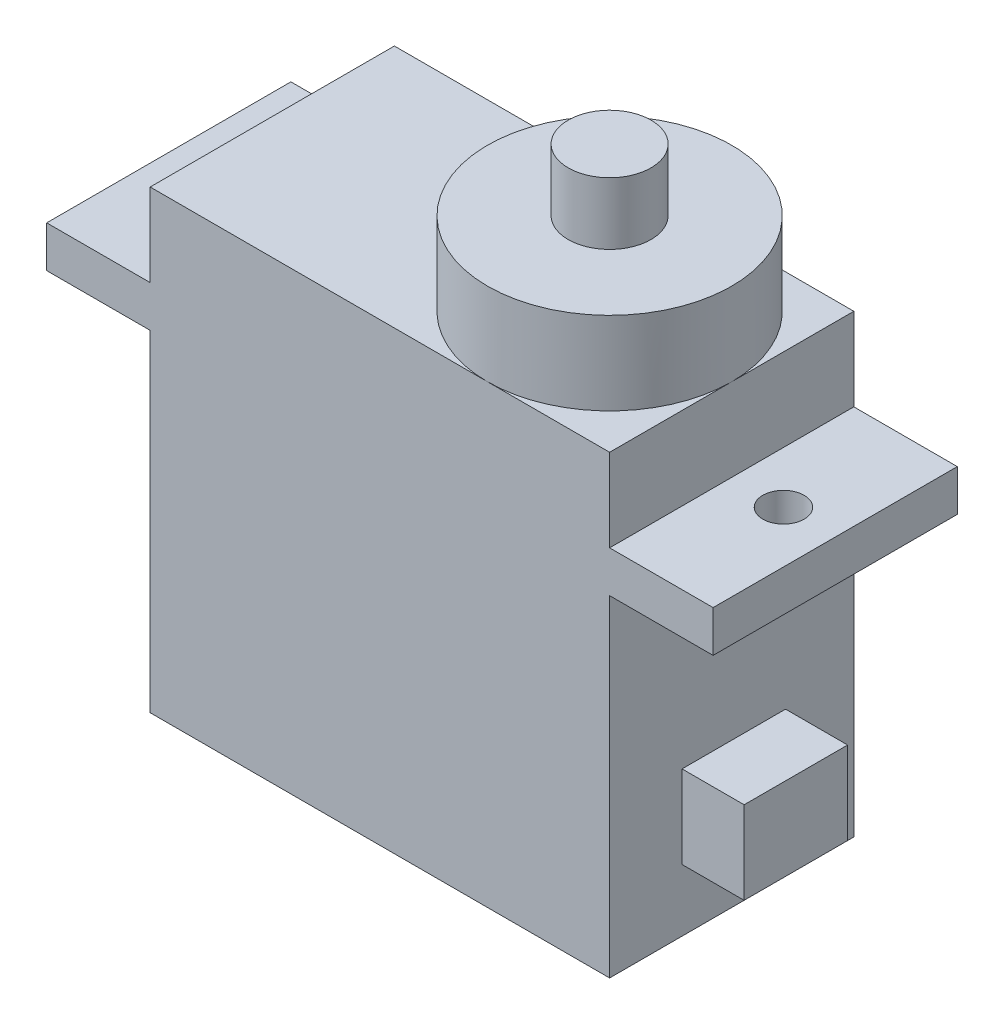
ISO-10303-21;
HEADER;
FILE_DESCRIPTION(('STEP AP214'),'2;1');
FILE_NAME('part.step','',(''),(''),'','','');
FILE_SCHEMA(('AUTOMOTIVE_DESIGN { 1 0 10303 214 1 1 1 1 }'));
ENDSEC;
DATA;
#1=APPLICATION_CONTEXT('core data for automotive mechanical design processes');
#2=APPLICATION_PROTOCOL_DEFINITION('international standard','automotive_design',2000,#1);
#3=PRODUCT_CONTEXT('',#1,'mechanical');
#4=PRODUCT('Part','Part','',(#3));
#5=PRODUCT_RELATED_PRODUCT_CATEGORY('part','',(#4));
#6=PRODUCT_DEFINITION_FORMATION('','',#4);
#7=PRODUCT_DEFINITION_CONTEXT('part definition',#1,'design');
#8=PRODUCT_DEFINITION('design','',#6,#7);
#9=PRODUCT_DEFINITION_SHAPE('','',#8);
#10=(LENGTH_UNIT() NAMED_UNIT(*) SI_UNIT(.MILLI.,.METRE.));
#11=(NAMED_UNIT(*) PLANE_ANGLE_UNIT() SI_UNIT($,.RADIAN.));
#12=(NAMED_UNIT(*) SI_UNIT($,.STERADIAN.) SOLID_ANGLE_UNIT());
#13=UNCERTAINTY_MEASURE_WITH_UNIT(LENGTH_MEASURE(1.E-05),#10,'distance_accuracy_value','');
#14=(GEOMETRIC_REPRESENTATION_CONTEXT(3) GLOBAL_UNCERTAINTY_ASSIGNED_CONTEXT((#13)) GLOBAL_UNIT_ASSIGNED_CONTEXT((#10,
#11,#12)) REPRESENTATION_CONTEXT('',''));
#15=CARTESIAN_POINT('',(0.,0.,0.));
#16=DIRECTION('',(0.,0.,1.));
#17=DIRECTION('',(1.,0.,0.));
#18=AXIS2_PLACEMENT_3D('',#15,#16,#17);
#19=CARTESIAN_POINT('',(-17.9964599489545,16.,11.8));
#20=DIRECTION('',(-1.,0.,0.));
#21=DIRECTION('',(0.,0.,1.));
#22=AXIS2_PLACEMENT_3D('',#19,#20,#21);
#23=PLANE('',#22);
#24=DIRECTION('',(0.,1.,0.));
#25=VECTOR('',#24,1.);
#26=CARTESIAN_POINT('',(-17.9964599489545,16.,0.));
#27=LINE('',#26,#25);
#28=CARTESIAN_POINT('',(-17.9964599489545,0.,0.));
#29=VERTEX_POINT('',#28);
#30=CARTESIAN_POINT('',(-17.9964599489545,16.,0.));
#31=VERTEX_POINT('',#30);
#32=EDGE_CURVE('E243',#29,#31,#27,.T.);
#33=ORIENTED_EDGE('',*,*,#32,.T.);
#34=DIRECTION('',(0.,0.,-1.));
#35=VECTOR('',#34,1.);
#36=CARTESIAN_POINT('',(-17.9964599489545,16.,11.8));
#37=LINE('',#36,#35);
#38=CARTESIAN_POINT('',(-17.9964599489545,16.,11.8));
#39=VERTEX_POINT('',#38);
#40=EDGE_CURVE('E282',#39,#31,#37,.T.);
#41=ORIENTED_EDGE('',*,*,#40,.F.);
#42=DIRECTION('',(0.,1.,0.));
#43=VECTOR('',#42,1.);
#44=CARTESIAN_POINT('',(-17.9964599489545,16.,11.8));
#45=LINE('',#44,#43);
#46=CARTESIAN_POINT('',(-17.9964599489545,0.,11.8));
#47=VERTEX_POINT('',#46);
#48=EDGE_CURVE('E217',#47,#39,#45,.T.);
#49=ORIENTED_EDGE('',*,*,#48,.F.);
#50=DIRECTION('',(0.,0.,-1.));
#51=VECTOR('',#50,1.);
#52=CARTESIAN_POINT('',(-17.9964599489545,0.,11.8));
#53=LINE('',#52,#51);
#54=EDGE_CURVE('E285',#47,#29,#53,.T.);
#55=ORIENTED_EDGE('',*,*,#54,.T.);
#56=EDGE_LOOP('',(#33,#41,#49,#55));
#57=FACE_BOUND('',#56,.T.);
#58=DIRECTION('',(0.,-1.,0.));
#59=VECTOR('',#58,1.);
#60=CARTESIAN_POINT('',(-17.9964599489545,2.99999999999999,8.3));
#61=LINE('',#60,#59);
#62=CARTESIAN_POINT('',(-17.9964599489545,6.99999999999999,8.3));
#63=VERTEX_POINT('',#62);
#64=CARTESIAN_POINT('',(-17.9964599489545,3.,8.3));
#65=VERTEX_POINT('',#64);
#66=EDGE_CURVE('E178',#63,#65,#61,.T.);
#67=ORIENTED_EDGE('',*,*,#66,.F.);
#68=DIRECTION('',(0.,0.,1.));
#69=VECTOR('',#68,1.);
#70=CARTESIAN_POINT('',(-17.9964599489545,6.99999999999999,8.3));
#71=LINE('',#70,#69);
#72=CARTESIAN_POINT('',(-17.9964599489545,7.,3.3));
#73=VERTEX_POINT('',#72);
#74=EDGE_CURVE('E175',#73,#63,#71,.T.);
#75=ORIENTED_EDGE('',*,*,#74,.F.);
#76=DIRECTION('',(0.,1.,0.));
#77=VECTOR('',#76,1.);
#78=CARTESIAN_POINT('',(-17.9964599489545,2.99999999999999,3.3));
#79=LINE('',#78,#77);
#80=CARTESIAN_POINT('',(-17.9964599489545,2.99999999999999,3.3));
#81=VERTEX_POINT('',#80);
#82=EDGE_CURVE('E56',#81,#73,#79,.T.);
#83=ORIENTED_EDGE('',*,*,#82,.F.);
#84=DIRECTION('',(0.,0.,-1.));
#85=VECTOR('',#84,1.);
#86=CARTESIAN_POINT('',(-17.9964599489545,2.99999999999999,8.3));
#87=LINE('',#86,#85);
#88=EDGE_CURVE('E51',#65,#81,#87,.T.);
#89=ORIENTED_EDGE('',*,*,#88,.F.);
#90=EDGE_LOOP('',(#67,#75,#83,#89));
#91=FACE_BOUND('',#90,.T.);
#92=ADVANCED_FACE('F33',(#57,#91),#23,.F.);
#93=CARTESIAN_POINT('',(-23.8964599489545,26.,5.9));
#94=DIRECTION('',(0.,1.,0.));
#95=DIRECTION('',(0.,0.,1.));
#96=AXIS2_PLACEMENT_3D('',#93,#94,#95);
#97=PLANE('',#96);
#98=CARTESIAN_POINT('',(-23.8964599489545,26.,5.9));
#99=DIRECTION('',(0.,1.,0.));
#100=DIRECTION('',(0.,0.,1.));
#101=AXIS2_PLACEMENT_3D('',#98,#99,#100);
#102=CIRCLE('',#101,5.9);
#103=CARTESIAN_POINT('',(-23.8964599489545,26.,11.8));
#104=VERTEX_POINT('',#103);
#105=EDGE_CURVE('E190',#104,#104,#102,.T.);
#106=ORIENTED_EDGE('',*,*,#105,.T.);
#107=EDGE_LOOP('',(#106));
#108=FACE_BOUND('',#107,.T.);
#109=CARTESIAN_POINT('',(-23.8964599489545,26.,5.9));
#110=DIRECTION('',(0.,1.,0.));
#111=DIRECTION('',(0.,0.,1.));
#112=AXIS2_PLACEMENT_3D('',#109,#110,#111);
#113=CIRCLE('',#112,2.);
#114=CARTESIAN_POINT('',(-23.8964599489545,26.,7.9));
#115=VERTEX_POINT('',#114);
#116=EDGE_CURVE('E179',#115,#115,#113,.T.);
#117=ORIENTED_EDGE('',*,*,#116,.F.);
#118=EDGE_LOOP('',(#117));
#119=FACE_BOUND('',#118,.T.);
#120=ADVANCED_FACE('F365',(#108,#119),#97,.T.);
#121=CARTESIAN_POINT('',(-40.1964599489545,22.,11.8));
#122=DIRECTION('',(0.,-1.,0.));
#123=DIRECTION('',(0.,0.,-1.));
#124=AXIS2_PLACEMENT_3D('',#121,#122,#123);
#125=PLANE('',#124);
#126=CARTESIAN_POINT('',(-23.8964599489545,22.,5.9));
#127=DIRECTION('',(0.,1.,0.));
#128=DIRECTION('',(0.,0.,1.));
#129=AXIS2_PLACEMENT_3D('',#126,#127,#128);
#130=CIRCLE('',#129,5.9);
#131=CARTESIAN_POINT('',(-23.8964599489545,22.,11.8));
#132=VERTEX_POINT('',#131);
#133=CARTESIAN_POINT('',(-17.9964599489545,22.,5.9));
#134=VERTEX_POINT('',#133);
#135=EDGE_CURVE('E44',#132,#134,#130,.T.);
#136=ORIENTED_EDGE('',*,*,#135,.F.);
#137=DIRECTION('',(-1.,0.,0.));
#138=VECTOR('',#137,1.);
#139=CARTESIAN_POINT('',(-40.1964599489545,22.,11.8));
#140=LINE('',#139,#138);
#141=CARTESIAN_POINT('',(-17.9964599489545,22.,11.8));
#142=VERTEX_POINT('',#141);
#143=EDGE_CURVE('E228',#142,#132,#140,.T.);
#144=ORIENTED_EDGE('',*,*,#143,.F.);
#145=DIRECTION('',(0.,0.,-1.));
#146=VECTOR('',#145,1.);
#147=CARTESIAN_POINT('',(-17.9964599489545,22.,11.8));
#148=LINE('',#147,#146);
#149=EDGE_CURVE('E270',#142,#134,#148,.T.);
#150=ORIENTED_EDGE('',*,*,#149,.T.);
#151=EDGE_LOOP('',(#136,#144,#150));
#152=FACE_BOUND('',#151,.T.);
#153=ADVANCED_FACE('F363',(#152),#125,.F.);
#154=CARTESIAN_POINT('',(-23.8964599489545,22.,0.));
#155=VERTEX_POINT('',#154);
#156=EDGE_CURVE('E11',#134,#155,#130,.T.);
#157=ORIENTED_EDGE('',*,*,#156,.F.);
#158=CARTESIAN_POINT('',(-17.9964599489545,22.,0.));
#159=VERTEX_POINT('',#158);
#160=EDGE_CURVE('E269',#134,#159,#148,.T.);
#161=ORIENTED_EDGE('',*,*,#160,.T.);
#162=DIRECTION('',(-1.,0.,0.));
#163=VECTOR('',#162,1.);
#164=CARTESIAN_POINT('',(-40.1964599489545,22.,0.));
#165=LINE('',#164,#163);
#166=EDGE_CURVE('E255',#159,#155,#165,.T.);
#167=ORIENTED_EDGE('',*,*,#166,.T.);
#168=EDGE_LOOP('',(#157,#161,#167));
#169=FACE_BOUND('',#168,.T.);
#170=ADVANCED_FACE('F316',(#169),#125,.F.);
#171=EDGE_CURVE('E42',#155,#132,#130,.T.);
#172=ORIENTED_EDGE('',*,*,#171,.F.);
#173=CARTESIAN_POINT('',(-40.1964599489545,22.,0.));
#174=VERTEX_POINT('',#173);
#175=EDGE_CURVE('E254',#155,#174,#165,.T.);
#176=ORIENTED_EDGE('',*,*,#175,.T.);
#177=DIRECTION('',(0.,0.,-1.));
#178=VECTOR('',#177,1.);
#179=CARTESIAN_POINT('',(-40.1964599489545,22.,11.8));
#180=LINE('',#179,#178);
#181=CARTESIAN_POINT('',(-40.1964599489545,22.,11.8));
#182=VERTEX_POINT('',#181);
#183=EDGE_CURVE('E266',#182,#174,#180,.T.);
#184=ORIENTED_EDGE('',*,*,#183,.F.);
#185=EDGE_CURVE('E227',#132,#182,#140,.T.);
#186=ORIENTED_EDGE('',*,*,#185,.F.);
#187=EDGE_LOOP('',(#172,#176,#184,#186));
#188=FACE_BOUND('',#187,.T.);
#189=ADVANCED_FACE('F306',(#188),#125,.F.);
#190=CARTESIAN_POINT('',(-45.1964599489545,16.,11.8));
#191=DIRECTION('',(1.,0.,0.));
#192=DIRECTION('',(0.,0.,-1.));
#193=AXIS2_PLACEMENT_3D('',#190,#191,#192);
#194=PLANE('',#193);
#195=DIRECTION('',(0.,-1.,0.));
#196=VECTOR('',#195,1.);
#197=CARTESIAN_POINT('',(-45.1964599489545,16.,0.));
#198=LINE('',#197,#196);
#199=CARTESIAN_POINT('',(-45.1964599489545,18.,0.));
#200=VERTEX_POINT('',#199);
#201=CARTESIAN_POINT('',(-45.1964599489545,16.,0.));
#202=VERTEX_POINT('',#201);
#203=EDGE_CURVE('E206',#200,#202,#198,.T.);
#204=ORIENTED_EDGE('',*,*,#203,.T.);
#205=DIRECTION('',(0.,0.,-1.));
#206=VECTOR('',#205,1.);
#207=CARTESIAN_POINT('',(-45.1964599489545,16.,11.8));
#208=LINE('',#207,#206);
#209=CARTESIAN_POINT('',(-45.1964599489545,16.,11.8));
#210=VERTEX_POINT('',#209);
#211=EDGE_CURVE('E37',#210,#202,#208,.T.);
#212=ORIENTED_EDGE('',*,*,#211,.F.);
#213=DIRECTION('',(0.,-1.,0.));
#214=VECTOR('',#213,1.);
#215=CARTESIAN_POINT('',(-45.1964599489545,16.,11.8));
#216=LINE('',#215,#214);
#217=CARTESIAN_POINT('',(-45.1964599489545,18.,11.8));
#218=VERTEX_POINT('',#217);
#219=EDGE_CURVE('E207',#218,#210,#216,.T.);
#220=ORIENTED_EDGE('',*,*,#219,.F.);
#221=DIRECTION('',(0.,0.,-1.));
#222=VECTOR('',#221,1.);
#223=CARTESIAN_POINT('',(-45.1964599489545,18.,11.8));
#224=LINE('',#223,#222);
#225=EDGE_CURVE('E234',#218,#200,#224,.T.);
#226=ORIENTED_EDGE('',*,*,#225,.T.);
#227=EDGE_LOOP('',(#204,#212,#220,#226));
#228=FACE_BOUND('',#227,.T.);
#229=ADVANCED_FACE('F35',(#228),#194,.F.);
#230=CARTESIAN_POINT('',(-40.1964599489545,16.,11.8));
#231=DIRECTION('',(0.,1.,0.));
#232=DIRECTION('',(-1.,0.,0.));
#233=AXIS2_PLACEMENT_3D('',#230,#231,#232);
#234=PLANE('',#233);
#235=CARTESIAN_POINT('',(-42.6964599489545,16.,5.9));
#236=DIRECTION('',(0.,1.,0.));
#237=DIRECTION('',(-1.,0.,0.));
#238=AXIS2_PLACEMENT_3D('',#235,#236,#237);
#239=CIRCLE('',#238,0.999999999999998);
#240=CARTESIAN_POINT('',(-43.6964599489545,16.,5.9));
#241=VERTEX_POINT('',#240);
#242=EDGE_CURVE('E203',#241,#241,#239,.T.);
#243=ORIENTED_EDGE('',*,*,#242,.T.);
#244=EDGE_LOOP('',(#243));
#245=FACE_BOUND('',#244,.T.);
#246=DIRECTION('',(1.,0.,0.));
#247=VECTOR('',#246,1.);
#248=CARTESIAN_POINT('',(-40.1964599489545,16.,0.));
#249=LINE('',#248,#247);
#250=CARTESIAN_POINT('',(-40.1964599489545,16.,0.));
#251=VERTEX_POINT('',#250);
#252=EDGE_CURVE('E237',#202,#251,#249,.T.);
#253=ORIENTED_EDGE('',*,*,#252,.T.);
#254=DIRECTION('',(0.,0.,-1.));
#255=VECTOR('',#254,1.);
#256=CARTESIAN_POINT('',(-40.1964599489545,16.,11.8));
#257=LINE('',#256,#255);
#258=CARTESIAN_POINT('',(-40.1964599489545,16.,11.8));
#259=VERTEX_POINT('',#258);
#260=EDGE_CURVE('E290',#259,#251,#257,.T.);
#261=ORIENTED_EDGE('',*,*,#260,.F.);
#262=DIRECTION('',(1.,0.,0.));
#263=VECTOR('',#262,1.);
#264=CARTESIAN_POINT('',(-40.1964599489545,16.,11.8));
#265=LINE('',#264,#263);
#266=EDGE_CURVE('E210',#210,#259,#265,.T.);
#267=ORIENTED_EDGE('',*,*,#266,.F.);
#268=ORIENTED_EDGE('',*,*,#211,.T.);
#269=EDGE_LOOP('',(#253,#261,#267,#268));
#270=FACE_BOUND('',#269,.T.);
#271=ADVANCED_FACE('F348',(#245,#270),#234,.F.);
#272=CARTESIAN_POINT('',(-40.1964599489545,0.,11.8));
#273=DIRECTION('',(1.,0.,0.));
#274=DIRECTION('',(0.,0.,-1.));
#275=AXIS2_PLACEMENT_3D('',#272,#273,#274);
#276=PLANE('',#275);
#277=DIRECTION('',(0.,-1.,0.));
#278=VECTOR('',#277,1.);
#279=CARTESIAN_POINT('',(-40.1964599489545,0.,0.));
#280=LINE('',#279,#278);
#281=CARTESIAN_POINT('',(-40.1964599489545,0.,0.));
#282=VERTEX_POINT('',#281);
#283=EDGE_CURVE('E239',#251,#282,#280,.T.);
#284=ORIENTED_EDGE('',*,*,#283,.T.);
#285=DIRECTION('',(0.,0.,-1.));
#286=VECTOR('',#285,1.);
#287=CARTESIAN_POINT('',(-40.1964599489545,0.,11.8));
#288=LINE('',#287,#286);
#289=CARTESIAN_POINT('',(-40.1964599489545,0.,11.8));
#290=VERTEX_POINT('',#289);
#291=EDGE_CURVE('E288',#290,#282,#288,.T.);
#292=ORIENTED_EDGE('',*,*,#291,.F.);
#293=DIRECTION('',(0.,-1.,0.));
#294=VECTOR('',#293,1.);
#295=CARTESIAN_POINT('',(-40.1964599489545,0.,11.8));
#296=LINE('',#295,#294);
#297=EDGE_CURVE('E213',#259,#290,#296,.T.);
#298=ORIENTED_EDGE('',*,*,#297,.F.);
#299=ORIENTED_EDGE('',*,*,#260,.T.);
#300=EDGE_LOOP('',(#284,#292,#298,#299));
#301=FACE_BOUND('',#300,.T.);
#302=ADVANCED_FACE('F347',(#301),#276,.F.);
#303=CARTESIAN_POINT('',(-17.9964599489545,0.,11.8));
#304=DIRECTION('',(0.,1.,0.));
#305=DIRECTION('',(-1.,0.,0.));
#306=AXIS2_PLACEMENT_3D('',#303,#304,#305);
#307=PLANE('',#306);
#308=DIRECTION('',(1.,0.,0.));
#309=VECTOR('',#308,1.);
#310=CARTESIAN_POINT('',(-17.9964599489545,0.,0.));
#311=LINE('',#310,#309);
#312=EDGE_CURVE('E241',#282,#29,#311,.T.);
#313=ORIENTED_EDGE('',*,*,#312,.T.);
#314=ORIENTED_EDGE('',*,*,#54,.F.);
#315=DIRECTION('',(1.,0.,0.));
#316=VECTOR('',#315,1.);
#317=CARTESIAN_POINT('',(-17.9964599489545,0.,11.8));
#318=LINE('',#317,#316);
#319=EDGE_CURVE('E215',#290,#47,#318,.T.);
#320=ORIENTED_EDGE('',*,*,#319,.F.);
#321=ORIENTED_EDGE('',*,*,#291,.T.);
#322=EDGE_LOOP('',(#313,#314,#320,#321));
#323=FACE_BOUND('',#322,.T.);
#324=ADVANCED_FACE('F345',(#323),#307,.F.);
#325=CARTESIAN_POINT('',(-12.9964599489545,16.,11.8));
#326=DIRECTION('',(0.,1.,0.));
#327=DIRECTION('',(0.,0.,1.));
#328=AXIS2_PLACEMENT_3D('',#325,#326,#327);
#329=PLANE('',#328);
#330=CARTESIAN_POINT('',(-15.4964599489545,16.,5.9));
#331=DIRECTION('',(0.,1.,0.));
#332=DIRECTION('',(0.,0.,1.));
#333=AXIS2_PLACEMENT_3D('',#330,#331,#332);
#334=CIRCLE('',#333,1.);
#335=CARTESIAN_POINT('',(-15.4964599489545,16.,6.9));
#336=VERTEX_POINT('',#335);
#337=EDGE_CURVE('E197',#336,#336,#334,.T.);
#338=ORIENTED_EDGE('',*,*,#337,.T.);
#339=EDGE_LOOP('',(#338));
#340=FACE_BOUND('',#339,.T.);
#341=DIRECTION('',(1.,0.,0.));
#342=VECTOR('',#341,1.);
#343=CARTESIAN_POINT('',(-12.9964599489545,16.,0.));
#344=LINE('',#343,#342);
#345=CARTESIAN_POINT('',(-12.9964599489545,16.,0.));
#346=VERTEX_POINT('',#345);
#347=EDGE_CURVE('E245',#31,#346,#344,.T.);
#348=ORIENTED_EDGE('',*,*,#347,.T.);
#349=DIRECTION('',(0.,0.,-1.));
#350=VECTOR('',#349,1.);
#351=CARTESIAN_POINT('',(-12.9964599489545,16.,11.8));
#352=LINE('',#351,#350);
#353=CARTESIAN_POINT('',(-12.9964599489545,16.,11.8));
#354=VERTEX_POINT('',#353);
#355=EDGE_CURVE('E279',#354,#346,#352,.T.);
#356=ORIENTED_EDGE('',*,*,#355,.F.);
#357=DIRECTION('',(1.,0.,0.));
#358=VECTOR('',#357,1.);
#359=CARTESIAN_POINT('',(-12.9964599489545,16.,11.8));
#360=LINE('',#359,#358);
#361=EDGE_CURVE('E219',#39,#354,#360,.T.);
#362=ORIENTED_EDGE('',*,*,#361,.F.);
#363=ORIENTED_EDGE('',*,*,#40,.T.);
#364=EDGE_LOOP('',(#348,#356,#362,#363));
#365=FACE_BOUND('',#364,.T.);
#366=ADVANCED_FACE('F336',(#340,#365),#329,.F.);
#367=CARTESIAN_POINT('',(-12.9964599489545,18.,11.8));
#368=DIRECTION('',(-1.,0.,0.));
#369=DIRECTION('',(0.,0.,1.));
#370=AXIS2_PLACEMENT_3D('',#367,#368,#369);
#371=PLANE('',#370);
#372=DIRECTION('',(0.,1.,0.));
#373=VECTOR('',#372,1.);
#374=CARTESIAN_POINT('',(-12.9964599489545,18.,0.));
#375=LINE('',#374,#373);
#376=CARTESIAN_POINT('',(-12.9964599489545,18.,0.));
#377=VERTEX_POINT('',#376);
#378=EDGE_CURVE('E247',#346,#377,#375,.T.);
#379=ORIENTED_EDGE('',*,*,#378,.T.);
#380=DIRECTION('',(0.,0.,-1.));
#381=VECTOR('',#380,1.);
#382=CARTESIAN_POINT('',(-12.9964599489545,18.,11.8));
#383=LINE('',#382,#381);
#384=CARTESIAN_POINT('',(-12.9964599489545,18.,11.8));
#385=VERTEX_POINT('',#384);
#386=EDGE_CURVE('E276',#385,#377,#383,.T.);
#387=ORIENTED_EDGE('',*,*,#386,.F.);
#388=DIRECTION('',(0.,1.,0.));
#389=VECTOR('',#388,1.);
#390=CARTESIAN_POINT('',(-12.9964599489545,18.,11.8));
#391=LINE('',#390,#389);
#392=EDGE_CURVE('E221',#354,#385,#391,.T.);
#393=ORIENTED_EDGE('',*,*,#392,.F.);
#394=ORIENTED_EDGE('',*,*,#355,.T.);
#395=EDGE_LOOP('',(#379,#387,#393,#394));
#396=FACE_BOUND('',#395,.T.);
#397=ADVANCED_FACE('F332',(#396),#371,.F.);
#398=CARTESIAN_POINT('',(-17.9964599489545,18.,11.8));
#399=DIRECTION('',(0.,-1.,0.));
#400=DIRECTION('',(0.,0.,-1.));
#401=AXIS2_PLACEMENT_3D('',#398,#399,#400);
#402=PLANE('',#401);
#403=CARTESIAN_POINT('',(-15.4964599489545,18.,5.9));
#404=DIRECTION('',(0.,1.,0.));
#405=DIRECTION('',(0.,0.,1.));
#406=AXIS2_PLACEMENT_3D('',#403,#404,#405);
#407=CIRCLE('',#406,1.);
#408=CARTESIAN_POINT('',(-15.4964599489545,18.,6.9));
#409=VERTEX_POINT('',#408);
#410=EDGE_CURVE('E192',#409,#409,#407,.T.);
#411=ORIENTED_EDGE('',*,*,#410,.F.);
#412=EDGE_LOOP('',(#411));
#413=FACE_BOUND('',#412,.T.);
#414=DIRECTION('',(-1.,0.,0.));
#415=VECTOR('',#414,1.);
#416=CARTESIAN_POINT('',(-17.9964599489545,18.,0.));
#417=LINE('',#416,#415);
#418=CARTESIAN_POINT('',(-17.9964599489545,18.,0.));
#419=VERTEX_POINT('',#418);
#420=EDGE_CURVE('E249',#377,#419,#417,.T.);
#421=ORIENTED_EDGE('',*,*,#420,.T.);
#422=DIRECTION('',(0.,0.,-1.));
#423=VECTOR('',#422,1.);
#424=CARTESIAN_POINT('',(-17.9964599489545,18.,11.8));
#425=LINE('',#424,#423);
#426=CARTESIAN_POINT('',(-17.9964599489545,18.,11.8));
#427=VERTEX_POINT('',#426);
#428=EDGE_CURVE('E273',#427,#419,#425,.T.);
#429=ORIENTED_EDGE('',*,*,#428,.F.);
#430=DIRECTION('',(-1.,0.,0.));
#431=VECTOR('',#430,1.);
#432=CARTESIAN_POINT('',(-17.9964599489545,18.,11.8));
#433=LINE('',#432,#431);
#434=EDGE_CURVE('E223',#385,#427,#433,.T.);
#435=ORIENTED_EDGE('',*,*,#434,.F.);
#436=ORIENTED_EDGE('',*,*,#386,.T.);
#437=EDGE_LOOP('',(#421,#429,#435,#436));
#438=FACE_BOUND('',#437,.T.);
#439=ADVANCED_FACE('F327',(#413,#438),#402,.F.);
#440=CARTESIAN_POINT('',(-17.9964599489545,22.,11.8));
#441=DIRECTION('',(-1.,0.,0.));
#442=DIRECTION('',(0.,-1.,0.));
#443=AXIS2_PLACEMENT_3D('',#440,#441,#442);
#444=PLANE('',#443);
#445=DIRECTION('',(0.,1.,0.));
#446=VECTOR('',#445,1.);
#447=CARTESIAN_POINT('',(-17.9964599489545,22.,0.));
#448=LINE('',#447,#446);
#449=EDGE_CURVE('E251',#419,#159,#448,.T.);
#450=ORIENTED_EDGE('',*,*,#449,.T.);
#451=ORIENTED_EDGE('',*,*,#160,.F.);
#452=ORIENTED_EDGE('',*,*,#149,.F.);
#453=DIRECTION('',(0.,1.,0.));
#454=VECTOR('',#453,1.);
#455=CARTESIAN_POINT('',(-17.9964599489545,22.,11.8));
#456=LINE('',#455,#454);
#457=EDGE_CURVE('E225',#427,#142,#456,.T.);
#458=ORIENTED_EDGE('',*,*,#457,.F.);
#459=ORIENTED_EDGE('',*,*,#428,.T.);
#460=EDGE_LOOP('',(#450,#451,#452,#458,#459));
#461=FACE_BOUND('',#460,.T.);
#462=ADVANCED_FACE('F320',(#461),#444,.F.);
#463=CARTESIAN_POINT('',(-40.1964599489545,18.,11.8));
#464=DIRECTION('',(1.,0.,0.));
#465=DIRECTION('',(0.,0.,-1.));
#466=AXIS2_PLACEMENT_3D('',#463,#464,#465);
#467=PLANE('',#466);
#468=DIRECTION('',(0.,-1.,0.));
#469=VECTOR('',#468,1.);
#470=CARTESIAN_POINT('',(-40.1964599489545,18.,0.));
#471=LINE('',#470,#469);
#472=CARTESIAN_POINT('',(-40.1964599489545,18.,0.));
#473=VERTEX_POINT('',#472);
#474=EDGE_CURVE('E258',#174,#473,#471,.T.);
#475=ORIENTED_EDGE('',*,*,#474,.T.);
#476=DIRECTION('',(0.,0.,-1.));
#477=VECTOR('',#476,1.);
#478=CARTESIAN_POINT('',(-40.1964599489545,18.,11.8));
#479=LINE('',#478,#477);
#480=CARTESIAN_POINT('',(-40.1964599489545,18.,11.8));
#481=VERTEX_POINT('',#480);
#482=EDGE_CURVE('E263',#481,#473,#479,.T.);
#483=ORIENTED_EDGE('',*,*,#482,.F.);
#484=DIRECTION('',(0.,-1.,0.));
#485=VECTOR('',#484,1.);
#486=CARTESIAN_POINT('',(-40.1964599489545,18.,11.8));
#487=LINE('',#486,#485);
#488=EDGE_CURVE('E230',#182,#481,#487,.T.);
#489=ORIENTED_EDGE('',*,*,#488,.F.);
#490=ORIENTED_EDGE('',*,*,#183,.T.);
#491=EDGE_LOOP('',(#475,#483,#489,#490));
#492=FACE_BOUND('',#491,.T.);
#493=ADVANCED_FACE('F360',(#492),#467,.F.);
#494=CARTESIAN_POINT('',(-45.1964599489545,18.,11.8));
#495=DIRECTION('',(0.,-1.,0.));
#496=DIRECTION('',(0.,0.,-1.));
#497=AXIS2_PLACEMENT_3D('',#494,#495,#496);
#498=PLANE('',#497);
#499=CARTESIAN_POINT('',(-42.6964599489545,18.,5.9));
#500=DIRECTION('',(0.,1.,0.));
#501=DIRECTION('',(0.,0.,1.));
#502=AXIS2_PLACEMENT_3D('',#499,#500,#501);
#503=CIRCLE('',#502,0.999999999999998);
#504=CARTESIAN_POINT('',(-42.6964599489545,18.,6.9));
#505=VERTEX_POINT('',#504);
#506=EDGE_CURVE('E200',#505,#505,#503,.T.);
#507=ORIENTED_EDGE('',*,*,#506,.F.);
#508=EDGE_LOOP('',(#507));
#509=FACE_BOUND('',#508,.T.);
#510=DIRECTION('',(-1.,0.,0.));
#511=VECTOR('',#510,1.);
#512=CARTESIAN_POINT('',(-45.1964599489545,18.,0.));
#513=LINE('',#512,#511);
#514=EDGE_CURVE('E211',#473,#200,#513,.T.);
#515=ORIENTED_EDGE('',*,*,#514,.T.);
#516=ORIENTED_EDGE('',*,*,#225,.F.);
#517=DIRECTION('',(-1.,0.,0.));
#518=VECTOR('',#517,1.);
#519=CARTESIAN_POINT('',(-45.1964599489545,18.,11.8));
#520=LINE('',#519,#518);
#521=EDGE_CURVE('E232',#481,#218,#520,.T.);
#522=ORIENTED_EDGE('',*,*,#521,.F.);
#523=ORIENTED_EDGE('',*,*,#482,.T.);
#524=EDGE_LOOP('',(#515,#516,#522,#523));
#525=FACE_BOUND('',#524,.T.);
#526=ADVANCED_FACE('F356',(#509,#525),#498,.F.);
#527=CARTESIAN_POINT('',(0.,0.,11.8));
#528=DIRECTION('',(0.,0.,-1.));
#529=DIRECTION('',(-1.,0.,0.));
#530=AXIS2_PLACEMENT_3D('',#527,#528,#529);
#531=PLANE('',#530);
#532=ORIENTED_EDGE('',*,*,#219,.T.);
#533=ORIENTED_EDGE('',*,*,#266,.T.);
#534=ORIENTED_EDGE('',*,*,#297,.T.);
#535=ORIENTED_EDGE('',*,*,#319,.T.);
#536=ORIENTED_EDGE('',*,*,#48,.T.);
#537=ORIENTED_EDGE('',*,*,#361,.T.);
#538=ORIENTED_EDGE('',*,*,#392,.T.);
#539=ORIENTED_EDGE('',*,*,#434,.T.);
#540=ORIENTED_EDGE('',*,*,#457,.T.);
#541=ORIENTED_EDGE('',*,*,#143,.T.);
#542=ORIENTED_EDGE('',*,*,#185,.T.);
#543=ORIENTED_EDGE('',*,*,#488,.T.);
#544=ORIENTED_EDGE('',*,*,#521,.T.);
#545=EDGE_LOOP('',(#532,#533,#534,#535,#536,#537,#538,#539,#540,#541,#542,#543,#544));
#546=FACE_BOUND('',#545,.T.);
#547=ADVANCED_FACE('F351',(#546),#531,.F.);
#548=CARTESIAN_POINT('',(0.,0.,0.));
#549=DIRECTION('',(0.,0.,-1.));
#550=DIRECTION('',(-1.,0.,0.));
#551=AXIS2_PLACEMENT_3D('',#548,#549,#550);
#552=PLANE('',#551);
#553=ORIENTED_EDGE('',*,*,#203,.F.);
#554=ORIENTED_EDGE('',*,*,#514,.F.);
#555=ORIENTED_EDGE('',*,*,#474,.F.);
#556=ORIENTED_EDGE('',*,*,#175,.F.);
#557=ORIENTED_EDGE('',*,*,#166,.F.);
#558=ORIENTED_EDGE('',*,*,#449,.F.);
#559=ORIENTED_EDGE('',*,*,#420,.F.);
#560=ORIENTED_EDGE('',*,*,#378,.F.);
#561=ORIENTED_EDGE('',*,*,#347,.F.);
#562=ORIENTED_EDGE('',*,*,#32,.F.);
#563=ORIENTED_EDGE('',*,*,#312,.F.);
#564=ORIENTED_EDGE('',*,*,#283,.F.);
#565=ORIENTED_EDGE('',*,*,#252,.F.);
#566=EDGE_LOOP('',(#553,#554,#555,#556,#557,#558,#559,#560,#561,#562,#563,#564,#565));
#567=FACE_BOUND('',#566,.T.);
#568=ADVANCED_FACE('F312',(#567),#552,.T.);
#569=CARTESIAN_POINT('',(-42.6964599489545,6.2,5.9));
#570=DIRECTION('',(0.,1.,0.));
#571=DIRECTION('',(0.,0.,1.));
#572=AXIS2_PLACEMENT_3D('',#569,#570,#571);
#573=CYLINDRICAL_SURFACE('',#572,0.999999999999998);
#574=ORIENTED_EDGE('',*,*,#506,.T.);
#575=EDGE_LOOP('',(#574));
#576=FACE_BOUND('',#575,.T.);
#577=ORIENTED_EDGE('',*,*,#242,.F.);
#578=EDGE_LOOP('',(#577));
#579=FACE_BOUND('',#578,.T.);
#580=ADVANCED_FACE('F393',(#576,#579),#573,.F.);
#581=CARTESIAN_POINT('',(-15.4964599489545,6.2,5.9));
#582=DIRECTION('',(0.,1.,0.));
#583=DIRECTION('',(0.,0.,1.));
#584=AXIS2_PLACEMENT_3D('',#581,#582,#583);
#585=CYLINDRICAL_SURFACE('',#584,1.);
#586=ORIENTED_EDGE('',*,*,#410,.T.);
#587=EDGE_LOOP('',(#586));
#588=FACE_BOUND('',#587,.T.);
#589=ORIENTED_EDGE('',*,*,#337,.F.);
#590=EDGE_LOOP('',(#589));
#591=FACE_BOUND('',#590,.T.);
#592=ADVANCED_FACE('F395',(#588,#591),#585,.F.);
#593=CARTESIAN_POINT('',(-23.8964599489545,26.,5.9));
#594=DIRECTION('',(0.,-1.,0.));
#595=DIRECTION('',(0.,0.,-1.));
#596=AXIS2_PLACEMENT_3D('',#593,#594,#595);
#597=CYLINDRICAL_SURFACE('',#596,5.9);
#598=ORIENTED_EDGE('',*,*,#105,.F.);
#599=EDGE_LOOP('',(#598));
#600=FACE_BOUND('',#599,.T.);
#601=ORIENTED_EDGE('',*,*,#135,.T.);
#602=ORIENTED_EDGE('',*,*,#156,.T.);
#603=ORIENTED_EDGE('',*,*,#171,.T.);
#604=EDGE_LOOP('',(#601,#602,#603));
#605=FACE_BOUND('',#604,.T.);
#606=ADVANCED_FACE('F301',(#600,#605),#597,.T.);
#607=CARTESIAN_POINT('',(-23.8964599489545,29.,5.9));
#608=DIRECTION('',(0.,-1.,0.));
#609=DIRECTION('',(0.,0.,-1.));
#610=AXIS2_PLACEMENT_3D('',#607,#608,#609);
#611=CYLINDRICAL_SURFACE('',#610,2.);
#612=CARTESIAN_POINT('',(-23.8964599489545,29.,5.9));
#613=DIRECTION('',(0.,1.,0.));
#614=DIRECTION('',(0.,0.,1.));
#615=AXIS2_PLACEMENT_3D('',#612,#613,#614);
#616=CIRCLE('',#615,2.);
#617=CARTESIAN_POINT('',(-23.8964599489545,29.,7.9));
#618=VERTEX_POINT('',#617);
#619=EDGE_CURVE('E182',#618,#618,#616,.T.);
#620=ORIENTED_EDGE('',*,*,#619,.F.);
#621=EDGE_LOOP('',(#620));
#622=FACE_BOUND('',#621,.T.);
#623=ORIENTED_EDGE('',*,*,#116,.T.);
#624=EDGE_LOOP('',(#623));
#625=FACE_BOUND('',#624,.T.);
#626=ADVANCED_FACE('F516',(#622,#625),#611,.T.);
#627=CARTESIAN_POINT('',(-23.8964599489545,29.,5.9));
#628=DIRECTION('',(0.,1.,0.));
#629=DIRECTION('',(0.,0.,1.));
#630=AXIS2_PLACEMENT_3D('',#627,#628,#629);
#631=PLANE('',#630);
#632=ORIENTED_EDGE('',*,*,#619,.T.);
#633=EDGE_LOOP('',(#632));
#634=FACE_BOUND('',#633,.T.);
#635=ADVANCED_FACE('F531',(#634),#631,.T.);
#636=CARTESIAN_POINT('',(-14.9964599489545,2.99999999999999,8.3));
#637=DIRECTION('',(0.,0.,-1.));
#638=DIRECTION('',(-1.,0.,0.));
#639=AXIS2_PLACEMENT_3D('',#636,#637,#638);
#640=PLANE('',#639);
#641=ORIENTED_EDGE('',*,*,#66,.T.);
#642=DIRECTION('',(-1.,0.,0.));
#643=VECTOR('',#642,1.);
#644=CARTESIAN_POINT('',(-14.9964599489545,2.99999999999999,8.3));
#645=LINE('',#644,#643);
#646=CARTESIAN_POINT('',(-14.9964599489545,2.99999999999999,8.3));
#647=VERTEX_POINT('',#646);
#648=EDGE_CURVE('E159',#647,#65,#645,.T.);
#649=ORIENTED_EDGE('',*,*,#648,.F.);
#650=DIRECTION('',(0.,-1.,0.));
#651=VECTOR('',#650,1.);
#652=CARTESIAN_POINT('',(-14.9964599489545,2.99999999999999,8.3));
#653=LINE('',#652,#651);
#654=CARTESIAN_POINT('',(-14.9964599489545,6.99999999999999,8.3));
#655=VERTEX_POINT('',#654);
#656=EDGE_CURVE('E166',#655,#647,#653,.T.);
#657=ORIENTED_EDGE('',*,*,#656,.F.);
#658=DIRECTION('',(-1.,0.,0.));
#659=VECTOR('',#658,1.);
#660=CARTESIAN_POINT('',(-14.9964599489545,6.99999999999999,8.3));
#661=LINE('',#660,#659);
#662=EDGE_CURVE('E595',#655,#63,#661,.T.);
#663=ORIENTED_EDGE('',*,*,#662,.T.);
#664=EDGE_LOOP('',(#641,#649,#657,#663));
#665=FACE_BOUND('',#664,.T.);
#666=ADVANCED_FACE('F177',(#665),#640,.F.);
#667=CARTESIAN_POINT('',(-14.9964599489545,2.99999999999999,8.3));
#668=DIRECTION('',(0.,1.,0.));
#669=DIRECTION('',(0.,0.,1.));
#670=AXIS2_PLACEMENT_3D('',#667,#668,#669);
#671=PLANE('',#670);
#672=ORIENTED_EDGE('',*,*,#88,.T.);
#673=DIRECTION('',(-1.,0.,0.));
#674=VECTOR('',#673,1.);
#675=CARTESIAN_POINT('',(-14.9964599489545,2.99999999999999,3.3));
#676=LINE('',#675,#674);
#677=CARTESIAN_POINT('',(-14.9964599489545,2.99999999999999,3.3));
#678=VERTEX_POINT('',#677);
#679=EDGE_CURVE('E162',#678,#81,#676,.T.);
#680=ORIENTED_EDGE('',*,*,#679,.F.);
#681=DIRECTION('',(0.,0.,-1.));
#682=VECTOR('',#681,1.);
#683=CARTESIAN_POINT('',(-14.9964599489545,2.99999999999999,8.3));
#684=LINE('',#683,#682);
#685=EDGE_CURVE('E155',#647,#678,#684,.T.);
#686=ORIENTED_EDGE('',*,*,#685,.F.);
#687=ORIENTED_EDGE('',*,*,#648,.T.);
#688=EDGE_LOOP('',(#672,#680,#686,#687));
#689=FACE_BOUND('',#688,.T.);
#690=ADVANCED_FACE('F157',(#689),#671,.F.);
#691=CARTESIAN_POINT('',(-14.9964599489545,2.99999999999999,3.3));
#692=DIRECTION('',(0.,0.,1.));
#693=DIRECTION('',(1.,0.,0.));
#694=AXIS2_PLACEMENT_3D('',#691,#692,#693);
#695=PLANE('',#694);
#696=ORIENTED_EDGE('',*,*,#82,.T.);
#697=DIRECTION('',(-1.,0.,0.));
#698=VECTOR('',#697,1.);
#699=CARTESIAN_POINT('',(-14.9964599489545,6.99999999999999,3.3));
#700=LINE('',#699,#698);
#701=CARTESIAN_POINT('',(-14.9964599489545,6.99999999999999,3.3));
#702=VERTEX_POINT('',#701);
#703=EDGE_CURVE('E184',#702,#73,#700,.T.);
#704=ORIENTED_EDGE('',*,*,#703,.F.);
#705=DIRECTION('',(0.,1.,0.));
#706=VECTOR('',#705,1.);
#707=CARTESIAN_POINT('',(-14.9964599489545,2.99999999999999,3.3));
#708=LINE('',#707,#706);
#709=EDGE_CURVE('E165',#678,#702,#708,.T.);
#710=ORIENTED_EDGE('',*,*,#709,.F.);
#711=ORIENTED_EDGE('',*,*,#679,.T.);
#712=EDGE_LOOP('',(#696,#704,#710,#711));
#713=FACE_BOUND('',#712,.T.);
#714=ADVANCED_FACE('F562',(#713),#695,.F.);
#715=CARTESIAN_POINT('',(-14.9964599489545,6.99999999999999,8.3));
#716=DIRECTION('',(0.,-1.,0.));
#717=DIRECTION('',(0.,0.,-1.));
#718=AXIS2_PLACEMENT_3D('',#715,#716,#717);
#719=PLANE('',#718);
#720=ORIENTED_EDGE('',*,*,#74,.T.);
#721=ORIENTED_EDGE('',*,*,#662,.F.);
#722=DIRECTION('',(0.,0.,1.));
#723=VECTOR('',#722,1.);
#724=CARTESIAN_POINT('',(-14.9964599489545,6.99999999999999,8.3));
#725=LINE('',#724,#723);
#726=EDGE_CURVE('E171',#702,#655,#725,.T.);
#727=ORIENTED_EDGE('',*,*,#726,.F.);
#728=ORIENTED_EDGE('',*,*,#703,.T.);
#729=EDGE_LOOP('',(#720,#721,#727,#728));
#730=FACE_BOUND('',#729,.T.);
#731=ADVANCED_FACE('F571',(#730),#719,.F.);
#732=CARTESIAN_POINT('',(-14.9964599489545,0.,0.));
#733=DIRECTION('',(-1.,0.,0.));
#734=DIRECTION('',(0.,0.,1.));
#735=AXIS2_PLACEMENT_3D('',#732,#733,#734);
#736=PLANE('',#735);
#737=ORIENTED_EDGE('',*,*,#656,.T.);
#738=ORIENTED_EDGE('',*,*,#685,.T.);
#739=ORIENTED_EDGE('',*,*,#709,.T.);
#740=ORIENTED_EDGE('',*,*,#726,.T.);
#741=EDGE_LOOP('',(#737,#738,#739,#740));
#742=FACE_BOUND('',#741,.T.);
#743=ADVANCED_FACE('F169',(#742),#736,.F.);
#744=CLOSED_SHELL('',(#92,#120,#153,#170,#189,#229,#271,#302,#324,#366,#397,#439,#462,#493,#526,
#547,#568,#580,#592,#606,#626,#635,#666,#690,#714,#731,#743));
#745=MANIFOLD_SOLID_BREP('B2',#744);
#746=ADVANCED_BREP_SHAPE_REPRESENTATION('',(#18,#745),#14);
#747=SHAPE_DEFINITION_REPRESENTATION(#9,#746);
ENDSEC;
END-ISO-10303-21;
